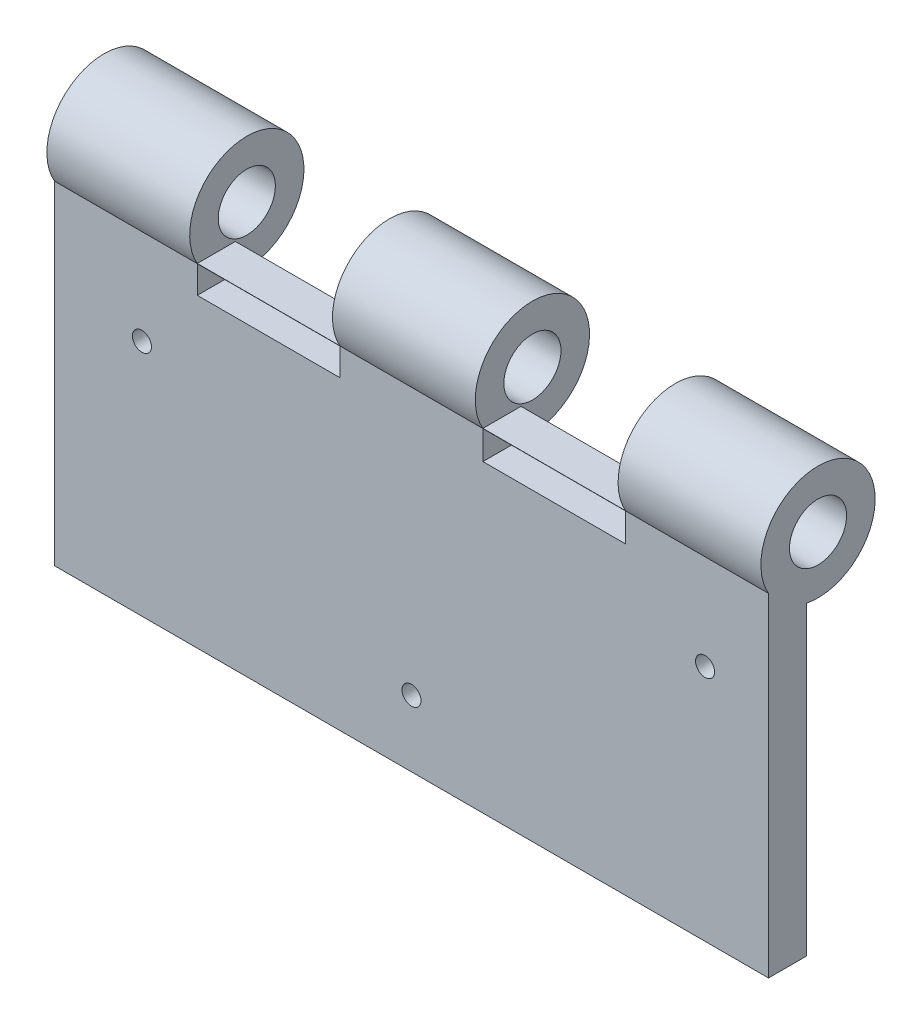
ISO-10303-21;
HEADER;
FILE_DESCRIPTION(('STEP AP214'),'2;1');
FILE_NAME('part.step','',(''),(''),'','','');
FILE_SCHEMA(('AUTOMOTIVE_DESIGN { 1 0 10303 214 1 1 1 1 }'));
ENDSEC;
DATA;
#1=APPLICATION_CONTEXT('core data for automotive mechanical design processes');
#2=APPLICATION_PROTOCOL_DEFINITION('international standard','automotive_design',2000,#1);
#3=PRODUCT_CONTEXT('',#1,'mechanical');
#4=PRODUCT('Part','Part','',(#3));
#5=PRODUCT_RELATED_PRODUCT_CATEGORY('part','',(#4));
#6=PRODUCT_DEFINITION_FORMATION('','',#4);
#7=PRODUCT_DEFINITION_CONTEXT('part definition',#1,'design');
#8=PRODUCT_DEFINITION('design','',#6,#7);
#9=PRODUCT_DEFINITION_SHAPE('','',#8);
#10=(LENGTH_UNIT() NAMED_UNIT(*) SI_UNIT(.MILLI.,.METRE.));
#11=(NAMED_UNIT(*) PLANE_ANGLE_UNIT() SI_UNIT($,.RADIAN.));
#12=(NAMED_UNIT(*) SI_UNIT($,.STERADIAN.) SOLID_ANGLE_UNIT());
#13=UNCERTAINTY_MEASURE_WITH_UNIT(LENGTH_MEASURE(1.E-05),#10,'distance_accuracy_value','');
#14=(GEOMETRIC_REPRESENTATION_CONTEXT(3) GLOBAL_UNCERTAINTY_ASSIGNED_CONTEXT((#13)) GLOBAL_UNIT_ASSIGNED_CONTEXT((#10,
#11,#12)) REPRESENTATION_CONTEXT('',''));
#15=CARTESIAN_POINT('',(0.,0.,0.));
#16=DIRECTION('',(0.,0.,1.));
#17=DIRECTION('',(1.,0.,0.));
#18=AXIS2_PLACEMENT_3D('',#15,#16,#17);
#19=CARTESIAN_POINT('',(0.,0.,-4.));
#20=DIRECTION('',(0.,0.,1.));
#21=DIRECTION('',(1.,0.,0.));
#22=AXIS2_PLACEMENT_3D('',#19,#20,#21);
#23=PLANE('',#22);
#24=DIRECTION('',(0.,1.,0.));
#25=VECTOR('',#24,1.);
#26=CARTESIAN_POINT('',(-15.,0.,-4.));
#27=LINE('',#26,#25);
#28=CARTESIAN_POINT('',(-15.,34.9537531894075,-4.));
#29=VERTEX_POINT('',#28);
#30=CARTESIAN_POINT('',(-15.,35.,-4.));
#31=VERTEX_POINT('',#30);
#32=EDGE_CURVE('E217',#29,#31,#27,.T.);
#33=ORIENTED_EDGE('',*,*,#32,.F.);
#34=DIRECTION('',(1.,0.,0.));
#35=VECTOR('',#34,1.);
#36=CARTESIAN_POINT('',(-15.,34.9537531894075,-4.));
#37=LINE('',#36,#35);
#38=CARTESIAN_POINT('',(-45.,34.9537531894075,-4.));
#39=VERTEX_POINT('',#38);
#40=EDGE_CURVE('E197',#39,#29,#37,.T.);
#41=ORIENTED_EDGE('',*,*,#40,.F.);
#42=DIRECTION('',(0.,1.,0.));
#43=VECTOR('',#42,1.);
#44=CARTESIAN_POINT('',(-45.,0.,-4.));
#45=LINE('',#44,#43);
#46=CARTESIAN_POINT('',(-45.,35.,-4.));
#47=VERTEX_POINT('',#46);
#48=EDGE_CURVE('E295',#39,#47,#45,.T.);
#49=ORIENTED_EDGE('',*,*,#48,.T.);
#50=DIRECTION('',(-1.,0.,0.));
#51=VECTOR('',#50,1.);
#52=CARTESIAN_POINT('',(75.,35.,-4.));
#53=LINE('',#52,#51);
#54=EDGE_CURVE('E280',#31,#47,#53,.T.);
#55=ORIENTED_EDGE('',*,*,#54,.F.);
#56=EDGE_LOOP('',(#33,#41,#49,#55));
#57=FACE_BOUND('',#56,.T.);
#58=ADVANCED_FACE('F58',(#57),#23,.F.);
#59=DIRECTION('',(0.,1.,0.));
#60=VECTOR('',#59,1.);
#61=CARTESIAN_POINT('',(45.,0.,-4.));
#62=LINE('',#61,#60);
#63=CARTESIAN_POINT('',(45.,34.9537531894075,-4.));
#64=VERTEX_POINT('',#63);
#65=CARTESIAN_POINT('',(45.,35.,-4.));
#66=VERTEX_POINT('',#65);
#67=EDGE_CURVE('E288',#64,#66,#62,.T.);
#68=ORIENTED_EDGE('',*,*,#67,.F.);
#69=DIRECTION('',(1.,0.,0.));
#70=VECTOR('',#69,1.);
#71=CARTESIAN_POINT('',(45.,34.9537531894075,-4.));
#72=LINE('',#71,#70);
#73=CARTESIAN_POINT('',(15.,34.9537531894075,-4.));
#74=VERTEX_POINT('',#73);
#75=EDGE_CURVE('E448',#74,#64,#72,.T.);
#76=ORIENTED_EDGE('',*,*,#75,.F.);
#77=DIRECTION('',(0.,1.,0.));
#78=VECTOR('',#77,1.);
#79=CARTESIAN_POINT('',(15.,0.,-4.));
#80=LINE('',#79,#78);
#81=CARTESIAN_POINT('',(15.,35.,-4.));
#82=VERTEX_POINT('',#81);
#83=EDGE_CURVE('E218',#74,#82,#80,.T.);
#84=ORIENTED_EDGE('',*,*,#83,.T.);
#85=EDGE_CURVE('E264',#66,#82,#53,.T.);
#86=ORIENTED_EDGE('',*,*,#85,.F.);
#87=EDGE_LOOP('',(#68,#76,#84,#86));
#88=FACE_BOUND('',#87,.T.);
#89=ADVANCED_FACE('F326',(#88),#23,.F.);
#90=CARTESIAN_POINT('',(75.,35.,4.));
#91=DIRECTION('',(0.,-1.,0.));
#92=DIRECTION('',(1.,0.,0.));
#93=AXIS2_PLACEMENT_3D('',#90,#91,#92);
#94=PLANE('',#93);
#95=ORIENTED_EDGE('',*,*,#54,.T.);
#96=DIRECTION('',(0.,0.,1.));
#97=VECTOR('',#96,1.);
#98=CARTESIAN_POINT('',(-45.,35.,4.));
#99=LINE('',#98,#97);
#100=CARTESIAN_POINT('',(-45.,35.,4.));
#101=VERTEX_POINT('',#100);
#102=EDGE_CURVE('E417',#47,#101,#99,.T.);
#103=ORIENTED_EDGE('',*,*,#102,.T.);
#104=DIRECTION('',(-1.,0.,0.));
#105=VECTOR('',#104,1.);
#106=CARTESIAN_POINT('',(75.,35.,4.));
#107=LINE('',#106,#105);
#108=CARTESIAN_POINT('',(-15.,35.,4.));
#109=VERTEX_POINT('',#108);
#110=EDGE_CURVE('E269',#109,#101,#107,.T.);
#111=ORIENTED_EDGE('',*,*,#110,.F.);
#112=DIRECTION('',(0.,0.,1.));
#113=VECTOR('',#112,1.);
#114=CARTESIAN_POINT('',(-15.,35.,4.));
#115=LINE('',#114,#113);
#116=EDGE_CURVE('E236',#31,#109,#115,.T.);
#117=ORIENTED_EDGE('',*,*,#116,.F.);
#118=EDGE_LOOP('',(#95,#103,#111,#117));
#119=FACE_BOUND('',#118,.T.);
#120=ADVANCED_FACE('F346',(#119),#94,.F.);
#121=CARTESIAN_POINT('',(0.,0.,4.));
#122=DIRECTION('',(0.,0.,1.));
#123=DIRECTION('',(1.,0.,0.));
#124=AXIS2_PLACEMENT_3D('',#121,#122,#123);
#125=PLANE('',#124);
#126=DIRECTION('',(0.,1.,0.));
#127=VECTOR('',#126,1.);
#128=CARTESIAN_POINT('',(-15.,0.,4.));
#129=LINE('',#128,#127);
#130=CARTESIAN_POINT('',(-15.,29.1962923306309,4.));
#131=VERTEX_POINT('',#130);
#132=CARTESIAN_POINT('',(-15.,34.9537531894075,4.));
#133=VERTEX_POINT('',#132);
#134=EDGE_CURVE('E485',#131,#133,#129,.T.);
#135=ORIENTED_EDGE('',*,*,#134,.F.);
#136=DIRECTION('',(1.,0.,0.));
#137=VECTOR('',#136,1.);
#138=CARTESIAN_POINT('',(0.,29.1962923306309,4.));
#139=LINE('',#138,#137);
#140=CARTESIAN_POINT('',(-45.,29.1962923306309,4.));
#141=VERTEX_POINT('',#140);
#142=EDGE_CURVE('E193',#141,#131,#139,.T.);
#143=ORIENTED_EDGE('',*,*,#142,.F.);
#144=DIRECTION('',(0.,-1.,0.));
#145=VECTOR('',#144,1.);
#146=CARTESIAN_POINT('',(-45.,0.,4.));
#147=LINE('',#146,#145);
#148=CARTESIAN_POINT('',(-45.,34.9537531894075,4.));
#149=VERTEX_POINT('',#148);
#150=EDGE_CURVE('E487',#149,#141,#147,.T.);
#151=ORIENTED_EDGE('',*,*,#150,.F.);
#152=DIRECTION('',(-1.,0.,0.));
#153=VECTOR('',#152,1.);
#154=CARTESIAN_POINT('',(0.,34.9537531894075,4.));
#155=LINE('',#154,#153);
#156=EDGE_CURVE('E491',#133,#149,#155,.T.);
#157=ORIENTED_EDGE('',*,*,#156,.F.);
#158=EDGE_LOOP('',(#135,#143,#151,#157));
#159=FACE_BOUND('',#158,.T.);
#160=DIRECTION('',(0.,1.,0.));
#161=VECTOR('',#160,1.);
#162=CARTESIAN_POINT('',(45.,0.,4.));
#163=LINE('',#162,#161);
#164=CARTESIAN_POINT('',(45.,28.9537531894075,4.));
#165=VERTEX_POINT('',#164);
#166=CARTESIAN_POINT('',(45.,34.9537531894075,4.));
#167=VERTEX_POINT('',#166);
#168=EDGE_CURVE('E464',#165,#167,#163,.T.);
#169=ORIENTED_EDGE('',*,*,#168,.F.);
#170=DIRECTION('',(1.,0.,0.));
#171=VECTOR('',#170,1.);
#172=CARTESIAN_POINT('',(0.,28.9537531894075,4.));
#173=LINE('',#172,#171);
#174=CARTESIAN_POINT('',(15.,28.9537531894075,4.));
#175=VERTEX_POINT('',#174);
#176=EDGE_CURVE('E402',#175,#165,#173,.T.);
#177=ORIENTED_EDGE('',*,*,#176,.F.);
#178=DIRECTION('',(0.,-1.,0.));
#179=VECTOR('',#178,1.);
#180=CARTESIAN_POINT('',(15.,0.,4.));
#181=LINE('',#180,#179);
#182=CARTESIAN_POINT('',(15.,34.9537531894075,4.));
#183=VERTEX_POINT('',#182);
#184=EDGE_CURVE('E463',#183,#175,#181,.T.);
#185=ORIENTED_EDGE('',*,*,#184,.F.);
#186=DIRECTION('',(-1.,0.,0.));
#187=VECTOR('',#186,1.);
#188=CARTESIAN_POINT('',(0.,34.9537531894075,4.));
#189=LINE('',#188,#187);
#190=EDGE_CURVE('E459',#167,#183,#189,.T.);
#191=ORIENTED_EDGE('',*,*,#190,.F.);
#192=EDGE_LOOP('',(#169,#177,#185,#191));
#193=FACE_BOUND('',#192,.T.);
#194=CARTESIAN_POINT('',(-56.6305018989095,15.0158637322288,4.));
#195=DIRECTION('',(0.,0.,1.));
#196=DIRECTION('',(1.,0.,0.));
#197=AXIS2_PLACEMENT_3D('',#194,#195,#196);
#198=CIRCLE('',#197,2.);
#199=CARTESIAN_POINT('',(-54.6305018989095,15.0158637322288,4.));
#200=VERTEX_POINT('',#199);
#201=EDGE_CURVE('E390',#200,#200,#198,.T.);
#202=ORIENTED_EDGE('',*,*,#201,.F.);
#203=EDGE_LOOP('',(#202));
#204=FACE_BOUND('',#203,.T.);
#205=CARTESIAN_POINT('',(0.,-21.058085923715,4.));
#206=DIRECTION('',(0.,0.,1.));
#207=DIRECTION('',(1.,0.,0.));
#208=AXIS2_PLACEMENT_3D('',#205,#206,#207);
#209=CIRCLE('',#208,2.);
#210=CARTESIAN_POINT('',(2.,-21.058085923715,4.));
#211=VERTEX_POINT('',#210);
#212=EDGE_CURVE('E393',#211,#211,#209,.T.);
#213=ORIENTED_EDGE('',*,*,#212,.F.);
#214=EDGE_LOOP('',(#213));
#215=FACE_BOUND('',#214,.T.);
#216=CARTESIAN_POINT('',(61.6696567288971,15.0158637322288,4.));
#217=DIRECTION('',(0.,0.,1.));
#218=DIRECTION('',(1.,0.,0.));
#219=AXIS2_PLACEMENT_3D('',#216,#217,#218);
#220=CIRCLE('',#219,2.);
#221=CARTESIAN_POINT('',(63.6696567288971,15.0158637322288,4.));
#222=VERTEX_POINT('',#221);
#223=EDGE_CURVE('E399',#222,#222,#220,.T.);
#224=ORIENTED_EDGE('',*,*,#223,.F.);
#225=EDGE_LOOP('',(#224));
#226=FACE_BOUND('',#225,.T.);
#227=DIRECTION('',(1.,0.,0.));
#228=VECTOR('',#227,1.);
#229=CARTESIAN_POINT('',(-75.,34.9678665123082,4.));
#230=LINE('',#229,#228);
#231=CARTESIAN_POINT('',(-75.,34.9678665123082,4.));
#232=VERTEX_POINT('',#231);
#233=CARTESIAN_POINT('',(-45.,34.9678665123082,4.));
#234=VERTEX_POINT('',#233);
#235=EDGE_CURVE('E415',#232,#234,#230,.T.);
#236=ORIENTED_EDGE('',*,*,#235,.F.);
#237=DIRECTION('',(0.,-1.,0.));
#238=VECTOR('',#237,1.);
#239=CARTESIAN_POINT('',(-75.,-35.,4.));
#240=LINE('',#239,#238);
#241=CARTESIAN_POINT('',(-75.,-35.,4.));
#242=VERTEX_POINT('',#241);
#243=EDGE_CURVE('E261',#232,#242,#240,.T.);
#244=ORIENTED_EDGE('',*,*,#243,.T.);
#245=DIRECTION('',(1.,0.,0.));
#246=VECTOR('',#245,1.);
#247=CARTESIAN_POINT('',(75.,-35.,4.));
#248=LINE('',#247,#246);
#249=CARTESIAN_POINT('',(75.,-35.,4.));
#250=VERTEX_POINT('',#249);
#251=EDGE_CURVE('E263',#242,#250,#248,.T.);
#252=ORIENTED_EDGE('',*,*,#251,.T.);
#253=DIRECTION('',(0.,1.,0.));
#254=VECTOR('',#253,1.);
#255=CARTESIAN_POINT('',(75.,-35.,4.));
#256=LINE('',#255,#254);
#257=CARTESIAN_POINT('',(75.,34.9678665123082,4.));
#258=VERTEX_POINT('',#257);
#259=EDGE_CURVE('E266',#250,#258,#256,.T.);
#260=ORIENTED_EDGE('',*,*,#259,.T.);
#261=DIRECTION('',(1.,0.,0.));
#262=VECTOR('',#261,1.);
#263=CARTESIAN_POINT('',(45.,34.9678665123082,4.));
#264=LINE('',#263,#262);
#265=CARTESIAN_POINT('',(45.,34.9678665123082,4.));
#266=VERTEX_POINT('',#265);
#267=EDGE_CURVE('E258',#266,#258,#264,.T.);
#268=ORIENTED_EDGE('',*,*,#267,.F.);
#269=DIRECTION('',(0.,1.,0.));
#270=VECTOR('',#269,1.);
#271=CARTESIAN_POINT('',(45.,0.,4.));
#272=LINE('',#271,#270);
#273=CARTESIAN_POINT('',(45.,35.,4.));
#274=VERTEX_POINT('',#273);
#275=EDGE_CURVE('E255',#266,#274,#272,.T.);
#276=ORIENTED_EDGE('',*,*,#275,.T.);
#277=CARTESIAN_POINT('',(15.,35.,4.));
#278=VERTEX_POINT('',#277);
#279=EDGE_CURVE('E270',#274,#278,#107,.T.);
#280=ORIENTED_EDGE('',*,*,#279,.T.);
#281=DIRECTION('',(0.,1.,0.));
#282=VECTOR('',#281,1.);
#283=CARTESIAN_POINT('',(15.,0.,4.));
#284=LINE('',#283,#282);
#285=CARTESIAN_POINT('',(15.,34.9678665123082,4.));
#286=VERTEX_POINT('',#285);
#287=EDGE_CURVE('E227',#286,#278,#284,.T.);
#288=ORIENTED_EDGE('',*,*,#287,.F.);
#289=DIRECTION('',(1.,0.,0.));
#290=VECTOR('',#289,1.);
#291=CARTESIAN_POINT('',(-15.,34.9678665123082,4.));
#292=LINE('',#291,#290);
#293=CARTESIAN_POINT('',(-15.,34.9678665123082,4.));
#294=VERTEX_POINT('',#293);
#295=EDGE_CURVE('E239',#294,#286,#292,.T.);
#296=ORIENTED_EDGE('',*,*,#295,.F.);
#297=DIRECTION('',(0.,1.,0.));
#298=VECTOR('',#297,1.);
#299=CARTESIAN_POINT('',(-15.,0.,4.));
#300=LINE('',#299,#298);
#301=EDGE_CURVE('E223',#294,#109,#300,.T.);
#302=ORIENTED_EDGE('',*,*,#301,.T.);
#303=ORIENTED_EDGE('',*,*,#110,.T.);
#304=DIRECTION('',(0.,1.,0.));
#305=VECTOR('',#304,1.);
#306=CARTESIAN_POINT('',(-45.,0.,4.));
#307=LINE('',#306,#305);
#308=EDGE_CURVE('E420',#234,#101,#307,.T.);
#309=ORIENTED_EDGE('',*,*,#308,.F.);
#310=EDGE_LOOP('',(#236,#244,#252,#260,#268,#276,#280,#288,#296,#302,#303,#309));
#311=FACE_BOUND('',#310,.T.);
#312=ADVANCED_FACE('F323',(#159,#193,#204,#215,#226,#311),#125,.T.);
#313=CARTESIAN_POINT('',(-56.6305018989095,15.0158637322288,-4.));
#314=DIRECTION('',(0.,0.,1.));
#315=DIRECTION('',(1.,0.,0.));
#316=AXIS2_PLACEMENT_3D('',#313,#314,#315);
#317=CIRCLE('',#316,5.99999999999998);
#318=CARTESIAN_POINT('',(-50.6305018989095,15.0158637322288,-4.));
#319=VERTEX_POINT('',#318);
#320=EDGE_CURVE('E303',#319,#319,#317,.T.);
#321=ORIENTED_EDGE('',*,*,#320,.T.);
#322=EDGE_LOOP('',(#321));
#323=FACE_BOUND('',#322,.T.);
#324=CARTESIAN_POINT('',(0.,-21.058085923715,-4.));
#325=DIRECTION('',(0.,0.,1.));
#326=DIRECTION('',(1.,0.,0.));
#327=AXIS2_PLACEMENT_3D('',#324,#325,#326);
#328=CIRCLE('',#327,5.99999999999998);
#329=CARTESIAN_POINT('',(5.99999999999998,-21.058085923715,-4.));
#330=VERTEX_POINT('',#329);
#331=EDGE_CURVE('E300',#330,#330,#328,.T.);
#332=ORIENTED_EDGE('',*,*,#331,.T.);
#333=EDGE_LOOP('',(#332));
#334=FACE_BOUND('',#333,.T.);
#335=CARTESIAN_POINT('',(61.6696567288971,15.0158637322288,-4.));
#336=DIRECTION('',(0.,0.,1.));
#337=DIRECTION('',(1.,0.,0.));
#338=AXIS2_PLACEMENT_3D('',#335,#336,#337);
#339=CIRCLE('',#338,5.99999999999994);
#340=CARTESIAN_POINT('',(67.6696567288971,15.0158637322288,-4.));
#341=VERTEX_POINT('',#340);
#342=EDGE_CURVE('E297',#341,#341,#339,.T.);
#343=ORIENTED_EDGE('',*,*,#342,.T.);
#344=EDGE_LOOP('',(#343));
#345=FACE_BOUND('',#344,.T.);
#346=DIRECTION('',(1.,0.,0.));
#347=VECTOR('',#346,1.);
#348=CARTESIAN_POINT('',(-75.,29.1962923306309,-4.));
#349=LINE('',#348,#347);
#350=CARTESIAN_POINT('',(-75.,29.1962923306309,-4.));
#351=VERTEX_POINT('',#350);
#352=CARTESIAN_POINT('',(-45.,29.1962923306309,-4.));
#353=VERTEX_POINT('',#352);
#354=EDGE_CURVE('E207',#351,#353,#349,.T.);
#355=ORIENTED_EDGE('',*,*,#354,.T.);
#356=DIRECTION('',(-1.,0.,0.));
#357=VECTOR('',#356,1.);
#358=CARTESIAN_POINT('',(-15.,29.1962923306309,-4.));
#359=LINE('',#358,#357);
#360=CARTESIAN_POINT('',(-15.,29.1962923306309,-4.));
#361=VERTEX_POINT('',#360);
#362=EDGE_CURVE('E191',#361,#353,#359,.T.);
#363=ORIENTED_EDGE('',*,*,#362,.F.);
#364=DIRECTION('',(1.,0.,0.));
#365=VECTOR('',#364,1.);
#366=CARTESIAN_POINT('',(-15.,29.1962923306309,-4.));
#367=LINE('',#366,#365);
#368=CARTESIAN_POINT('',(15.,29.1962923306309,-4.));
#369=VERTEX_POINT('',#368);
#370=EDGE_CURVE('E205',#361,#369,#367,.T.);
#371=ORIENTED_EDGE('',*,*,#370,.T.);
#372=DIRECTION('',(0.,1.,0.));
#373=VECTOR('',#372,1.);
#374=CARTESIAN_POINT('',(15.,34.9537531894075,-4.));
#375=LINE('',#374,#373);
#376=CARTESIAN_POINT('',(15.,28.9537531894075,-4.));
#377=VERTEX_POINT('',#376);
#378=EDGE_CURVE('E434',#377,#369,#375,.T.);
#379=ORIENTED_EDGE('',*,*,#378,.F.);
#380=DIRECTION('',(-1.,0.,0.));
#381=VECTOR('',#380,1.);
#382=CARTESIAN_POINT('',(45.,28.9537531894075,-4.));
#383=LINE('',#382,#381);
#384=CARTESIAN_POINT('',(45.,28.9537531894075,-4.));
#385=VERTEX_POINT('',#384);
#386=EDGE_CURVE('E453',#385,#377,#383,.T.);
#387=ORIENTED_EDGE('',*,*,#386,.F.);
#388=DIRECTION('',(0.,-1.,0.));
#389=VECTOR('',#388,1.);
#390=CARTESIAN_POINT('',(45.,34.9537531894075,-4.));
#391=LINE('',#390,#389);
#392=CARTESIAN_POINT('',(45.,29.1962923306309,-4.));
#393=VERTEX_POINT('',#392);
#394=EDGE_CURVE('E474',#393,#385,#391,.T.);
#395=ORIENTED_EDGE('',*,*,#394,.F.);
#396=DIRECTION('',(1.,0.,0.));
#397=VECTOR('',#396,1.);
#398=CARTESIAN_POINT('',(45.,29.1962923306309,-4.));
#399=LINE('',#398,#397);
#400=CARTESIAN_POINT('',(75.,29.1962923306309,-4.));
#401=VERTEX_POINT('',#400);
#402=EDGE_CURVE('E290',#393,#401,#399,.T.);
#403=ORIENTED_EDGE('',*,*,#402,.T.);
#404=DIRECTION('',(0.,1.,0.));
#405=VECTOR('',#404,1.);
#406=CARTESIAN_POINT('',(75.,-35.,-4.));
#407=LINE('',#406,#405);
#408=CARTESIAN_POINT('',(75.,-35.,-4.));
#409=VERTEX_POINT('',#408);
#410=EDGE_CURVE('E277',#409,#401,#407,.T.);
#411=ORIENTED_EDGE('',*,*,#410,.F.);
#412=DIRECTION('',(1.,0.,0.));
#413=VECTOR('',#412,1.);
#414=CARTESIAN_POINT('',(75.,-35.,-4.));
#415=LINE('',#414,#413);
#416=CARTESIAN_POINT('',(-75.,-35.,-4.));
#417=VERTEX_POINT('',#416);
#418=EDGE_CURVE('E275',#417,#409,#415,.T.);
#419=ORIENTED_EDGE('',*,*,#418,.F.);
#420=DIRECTION('',(0.,-1.,0.));
#421=VECTOR('',#420,1.);
#422=CARTESIAN_POINT('',(-75.,-35.,-4.));
#423=LINE('',#422,#421);
#424=EDGE_CURVE('E260',#351,#417,#423,.T.);
#425=ORIENTED_EDGE('',*,*,#424,.F.);
#426=EDGE_LOOP('',(#355,#363,#371,#379,#387,#395,#403,#411,#419,#425));
#427=FACE_BOUND('',#426,.T.);
#428=ADVANCED_FACE('F203',(#323,#334,#345,#427),#23,.F.);
#429=ORIENTED_EDGE('',*,*,#85,.T.);
#430=DIRECTION('',(0.,0.,1.));
#431=VECTOR('',#430,1.);
#432=CARTESIAN_POINT('',(15.,35.,4.));
#433=LINE('',#432,#431);
#434=EDGE_CURVE('E224',#82,#278,#433,.T.);
#435=ORIENTED_EDGE('',*,*,#434,.T.);
#436=ORIENTED_EDGE('',*,*,#279,.F.);
#437=DIRECTION('',(0.,0.,1.));
#438=VECTOR('',#437,1.);
#439=CARTESIAN_POINT('',(45.,35.,4.));
#440=LINE('',#439,#438);
#441=EDGE_CURVE('E251',#66,#274,#440,.T.);
#442=ORIENTED_EDGE('',*,*,#441,.F.);
#443=EDGE_LOOP('',(#429,#435,#436,#442));
#444=FACE_BOUND('',#443,.T.);
#445=ADVANCED_FACE('F322',(#444),#94,.F.);
#446=CARTESIAN_POINT('',(-75.,-35.,4.));
#447=DIRECTION('',(1.,0.,0.));
#448=DIRECTION('',(0.,0.,-1.));
#449=AXIS2_PLACEMENT_3D('',#446,#447,#448);
#450=PLANE('',#449);
#451=ORIENTED_EDGE('',*,*,#243,.F.);
#452=CARTESIAN_POINT('',(-75.,40.9537531894075,-6.40044040841181));
#453=DIRECTION('',(1.,0.,0.));
#454=DIRECTION('',(0.,0.,-1.));
#455=AXIS2_PLACEMENT_3D('',#452,#453,#454);
#456=CIRCLE('',#455,12.);
#457=EDGE_CURVE('E410',#351,#232,#456,.T.);
#458=ORIENTED_EDGE('',*,*,#457,.F.);
#459=ORIENTED_EDGE('',*,*,#424,.T.);
#460=DIRECTION('',(0.,0.,-1.));
#461=VECTOR('',#460,1.);
#462=CARTESIAN_POINT('',(-75.,-35.,4.));
#463=LINE('',#462,#461);
#464=EDGE_CURVE('E285',#242,#417,#463,.T.);
#465=ORIENTED_EDGE('',*,*,#464,.F.);
#466=EDGE_LOOP('',(#451,#458,#459,#465));
#467=FACE_BOUND('',#466,.T.);
#468=CARTESIAN_POINT('',(-75.,40.9537531894075,-6.40044040841181));
#469=DIRECTION('',(1.,0.,0.));
#470=DIRECTION('',(0.,0.,-1.));
#471=AXIS2_PLACEMENT_3D('',#468,#469,#470);
#472=CIRCLE('',#471,6.);
#473=CARTESIAN_POINT('',(-75.,40.9537531894075,-12.4004404084118));
#474=VERTEX_POINT('',#473);
#475=EDGE_CURVE('E396',#474,#474,#472,.T.);
#476=ORIENTED_EDGE('',*,*,#475,.T.);
#477=EDGE_LOOP('',(#476));
#478=FACE_BOUND('',#477,.T.);
#479=ADVANCED_FACE('F354',(#467,#478),#450,.F.);
#480=CARTESIAN_POINT('',(75.,-35.,4.));
#481=DIRECTION('',(0.,1.,0.));
#482=DIRECTION('',(-1.,0.,0.));
#483=AXIS2_PLACEMENT_3D('',#480,#481,#482);
#484=PLANE('',#483);
#485=ORIENTED_EDGE('',*,*,#418,.T.);
#486=DIRECTION('',(0.,0.,-1.));
#487=VECTOR('',#486,1.);
#488=CARTESIAN_POINT('',(75.,-35.,4.));
#489=LINE('',#488,#487);
#490=EDGE_CURVE('E273',#250,#409,#489,.T.);
#491=ORIENTED_EDGE('',*,*,#490,.F.);
#492=ORIENTED_EDGE('',*,*,#251,.F.);
#493=ORIENTED_EDGE('',*,*,#464,.T.);
#494=EDGE_LOOP('',(#485,#491,#492,#493));
#495=FACE_BOUND('',#494,.T.);
#496=ADVANCED_FACE('F360',(#495),#484,.F.);
#497=CARTESIAN_POINT('',(75.,-35.,4.));
#498=DIRECTION('',(-1.,0.,0.));
#499=DIRECTION('',(0.,0.,1.));
#500=AXIS2_PLACEMENT_3D('',#497,#498,#499);
#501=PLANE('',#500);
#502=ORIENTED_EDGE('',*,*,#410,.T.);
#503=CARTESIAN_POINT('',(75.,40.9537531894075,-6.40044040841181));
#504=DIRECTION('',(1.,0.,0.));
#505=DIRECTION('',(0.,0.,-1.));
#506=AXIS2_PLACEMENT_3D('',#503,#504,#505);
#507=CIRCLE('',#506,12.);
#508=EDGE_CURVE('E245',#401,#258,#507,.T.);
#509=ORIENTED_EDGE('',*,*,#508,.T.);
#510=ORIENTED_EDGE('',*,*,#259,.F.);
#511=ORIENTED_EDGE('',*,*,#490,.T.);
#512=EDGE_LOOP('',(#502,#509,#510,#511));
#513=FACE_BOUND('',#512,.T.);
#514=CARTESIAN_POINT('',(75.,40.9537531894075,-6.40044040841181));
#515=DIRECTION('',(1.,0.,0.));
#516=DIRECTION('',(0.,0.,-1.));
#517=AXIS2_PLACEMENT_3D('',#514,#515,#516);
#518=CIRCLE('',#517,6.);
#519=CARTESIAN_POINT('',(75.,40.9537531894075,-12.4004404084118));
#520=VERTEX_POINT('',#519);
#521=EDGE_CURVE('E241',#520,#520,#518,.T.);
#522=ORIENTED_EDGE('',*,*,#521,.F.);
#523=EDGE_LOOP('',(#522));
#524=FACE_BOUND('',#523,.T.);
#525=ADVANCED_FACE('F356',(#513,#524),#501,.F.);
#526=CARTESIAN_POINT('',(45.,40.9537531894075,-6.40044040841181));
#527=DIRECTION('',(1.,0.,0.));
#528=DIRECTION('',(0.,0.,-1.));
#529=AXIS2_PLACEMENT_3D('',#526,#527,#528);
#530=CYLINDRICAL_SURFACE('',#529,12.);
#531=CARTESIAN_POINT('',(45.,40.9537531894075,-6.40044040841181));
#532=DIRECTION('',(1.,0.,0.));
#533=DIRECTION('',(0.,0.,-1.));
#534=AXIS2_PLACEMENT_3D('',#531,#532,#533);
#535=CIRCLE('',#534,12.);
#536=EDGE_CURVE('E248',#393,#266,#535,.T.);
#537=ORIENTED_EDGE('',*,*,#536,.T.);
#538=ORIENTED_EDGE('',*,*,#267,.T.);
#539=ORIENTED_EDGE('',*,*,#508,.F.);
#540=ORIENTED_EDGE('',*,*,#402,.F.);
#541=EDGE_LOOP('',(#537,#538,#539,#540));
#542=FACE_BOUND('',#541,.T.);
#543=ADVANCED_FACE('F359',(#542),#530,.T.);
#544=CARTESIAN_POINT('',(45.,40.9537531894075,-6.40044040841181));
#545=DIRECTION('',(1.,0.,0.));
#546=DIRECTION('',(0.,0.,-1.));
#547=AXIS2_PLACEMENT_3D('',#544,#545,#546);
#548=PLANE('',#547);
#549=ORIENTED_EDGE('',*,*,#275,.F.);
#550=ORIENTED_EDGE('',*,*,#536,.F.);
#551=ORIENTED_EDGE('',*,*,#394,.T.);
#552=DIRECTION('',(0.,0.,-1.));
#553=VECTOR('',#552,1.);
#554=CARTESIAN_POINT('',(45.,28.9537531894075,6.));
#555=LINE('',#554,#553);
#556=EDGE_CURVE('E450',#165,#385,#555,.T.);
#557=ORIENTED_EDGE('',*,*,#556,.F.);
#558=ORIENTED_EDGE('',*,*,#168,.T.);
#559=DIRECTION('',(0.,0.,-1.));
#560=VECTOR('',#559,1.);
#561=CARTESIAN_POINT('',(45.,34.9537531894075,6.));
#562=LINE('',#561,#560);
#563=EDGE_CURVE('E457',#167,#64,#562,.T.);
#564=ORIENTED_EDGE('',*,*,#563,.T.);
#565=ORIENTED_EDGE('',*,*,#67,.T.);
#566=ORIENTED_EDGE('',*,*,#441,.T.);
#567=EDGE_LOOP('',(#549,#550,#551,#557,#558,#564,#565,#566));
#568=FACE_BOUND('',#567,.T.);
#569=CARTESIAN_POINT('',(45.,40.9537531894075,-6.40044040841181));
#570=DIRECTION('',(1.,0.,0.));
#571=DIRECTION('',(0.,0.,-1.));
#572=AXIS2_PLACEMENT_3D('',#569,#570,#571);
#573=CIRCLE('',#572,6.);
#574=CARTESIAN_POINT('',(45.,40.9537531894075,-12.4004404084118));
#575=VERTEX_POINT('',#574);
#576=EDGE_CURVE('E242',#575,#575,#573,.T.);
#577=ORIENTED_EDGE('',*,*,#576,.T.);
#578=EDGE_LOOP('',(#577));
#579=FACE_BOUND('',#578,.T.);
#580=ADVANCED_FACE('F471',(#568,#579),#548,.F.);
#581=CARTESIAN_POINT('',(45.,40.9537531894075,-6.40044040841181));
#582=DIRECTION('',(1.,0.,0.));
#583=DIRECTION('',(0.,0.,-1.));
#584=AXIS2_PLACEMENT_3D('',#581,#582,#583);
#585=CYLINDRICAL_SURFACE('',#584,6.);
#586=ORIENTED_EDGE('',*,*,#576,.F.);
#587=EDGE_LOOP('',(#586));
#588=FACE_BOUND('',#587,.T.);
#589=ORIENTED_EDGE('',*,*,#521,.T.);
#590=EDGE_LOOP('',(#589));
#591=FACE_BOUND('',#590,.T.);
#592=ADVANCED_FACE('F549',(#588,#591),#585,.F.);
#593=CARTESIAN_POINT('',(-15.,40.9537531894075,-6.40044040841181));
#594=DIRECTION('',(1.,0.,0.));
#595=DIRECTION('',(0.,0.,-1.));
#596=AXIS2_PLACEMENT_3D('',#593,#594,#595);
#597=CYLINDRICAL_SURFACE('',#596,12.);
#598=CARTESIAN_POINT('',(-15.,40.9537531894075,-6.40044040841181));
#599=DIRECTION('',(1.,0.,0.));
#600=DIRECTION('',(0.,0.,-1.));
#601=AXIS2_PLACEMENT_3D('',#598,#599,#600);
#602=CIRCLE('',#601,12.);
#603=EDGE_CURVE('E213',#361,#294,#602,.T.);
#604=ORIENTED_EDGE('',*,*,#603,.T.);
#605=ORIENTED_EDGE('',*,*,#295,.T.);
#606=CARTESIAN_POINT('',(15.,40.9537531894075,-6.40044040841181));
#607=DIRECTION('',(1.,0.,0.));
#608=DIRECTION('',(0.,0.,-1.));
#609=AXIS2_PLACEMENT_3D('',#606,#607,#608);
#610=CIRCLE('',#609,12.);
#611=EDGE_CURVE('E216',#369,#286,#610,.T.);
#612=ORIENTED_EDGE('',*,*,#611,.F.);
#613=ORIENTED_EDGE('',*,*,#370,.F.);
#614=EDGE_LOOP('',(#604,#605,#612,#613));
#615=FACE_BOUND('',#614,.T.);
#616=ADVANCED_FACE('F212',(#615),#597,.T.);
#617=CARTESIAN_POINT('',(-15.,40.9537531894075,-6.40044040841181));
#618=DIRECTION('',(1.,0.,0.));
#619=DIRECTION('',(0.,0.,-1.));
#620=AXIS2_PLACEMENT_3D('',#617,#618,#619);
#621=PLANE('',#620);
#622=ORIENTED_EDGE('',*,*,#301,.F.);
#623=ORIENTED_EDGE('',*,*,#603,.F.);
#624=DIRECTION('',(0.,0.,-1.));
#625=VECTOR('',#624,1.);
#626=CARTESIAN_POINT('',(-15.,29.1962923306309,6.));
#627=LINE('',#626,#625);
#628=EDGE_CURVE('E188',#131,#361,#627,.T.);
#629=ORIENTED_EDGE('',*,*,#628,.F.);
#630=ORIENTED_EDGE('',*,*,#134,.T.);
#631=DIRECTION('',(0.,0.,-1.));
#632=VECTOR('',#631,1.);
#633=CARTESIAN_POINT('',(-15.,34.9537531894075,6.));
#634=LINE('',#633,#632);
#635=EDGE_CURVE('E493',#133,#29,#634,.T.);
#636=ORIENTED_EDGE('',*,*,#635,.T.);
#637=ORIENTED_EDGE('',*,*,#32,.T.);
#638=ORIENTED_EDGE('',*,*,#116,.T.);
#639=EDGE_LOOP('',(#622,#623,#629,#630,#636,#637,#638));
#640=FACE_BOUND('',#639,.T.);
#641=CARTESIAN_POINT('',(-15.,40.9537531894075,-6.40044040841181));
#642=DIRECTION('',(1.,0.,0.));
#643=DIRECTION('',(0.,0.,-1.));
#644=AXIS2_PLACEMENT_3D('',#641,#642,#643);
#645=CIRCLE('',#644,6.);
#646=CARTESIAN_POINT('',(-15.,40.9537531894075,-12.4004404084118));
#647=VERTEX_POINT('',#646);
#648=EDGE_CURVE('E229',#647,#647,#645,.T.);
#649=ORIENTED_EDGE('',*,*,#648,.T.);
#650=EDGE_LOOP('',(#649));
#651=FACE_BOUND('',#650,.T.);
#652=ADVANCED_FACE('F220',(#640,#651),#621,.F.);
#653=CARTESIAN_POINT('',(15.,40.9537531894075,-6.40044040841181));
#654=DIRECTION('',(1.,0.,0.));
#655=DIRECTION('',(0.,0.,-1.));
#656=AXIS2_PLACEMENT_3D('',#653,#654,#655);
#657=PLANE('',#656);
#658=CARTESIAN_POINT('',(15.,40.9537531894075,-6.40044040841181));
#659=DIRECTION('',(1.,0.,0.));
#660=DIRECTION('',(0.,0.,-1.));
#661=AXIS2_PLACEMENT_3D('',#658,#659,#660);
#662=CIRCLE('',#661,6.);
#663=CARTESIAN_POINT('',(15.,40.9537531894075,-12.4004404084118));
#664=VERTEX_POINT('',#663);
#665=EDGE_CURVE('E232',#664,#664,#662,.T.);
#666=ORIENTED_EDGE('',*,*,#665,.F.);
#667=EDGE_LOOP('',(#666));
#668=FACE_BOUND('',#667,.T.);
#669=ORIENTED_EDGE('',*,*,#611,.T.);
#670=ORIENTED_EDGE('',*,*,#287,.T.);
#671=ORIENTED_EDGE('',*,*,#434,.F.);
#672=ORIENTED_EDGE('',*,*,#83,.F.);
#673=DIRECTION('',(0.,0.,-1.));
#674=VECTOR('',#673,1.);
#675=CARTESIAN_POINT('',(15.,34.9537531894075,6.));
#676=LINE('',#675,#674);
#677=EDGE_CURVE('E443',#183,#74,#676,.T.);
#678=ORIENTED_EDGE('',*,*,#677,.F.);
#679=ORIENTED_EDGE('',*,*,#184,.T.);
#680=DIRECTION('',(0.,0.,-1.));
#681=VECTOR('',#680,1.);
#682=CARTESIAN_POINT('',(15.,28.9537531894075,6.));
#683=LINE('',#682,#681);
#684=EDGE_CURVE('E82',#175,#377,#683,.T.);
#685=ORIENTED_EDGE('',*,*,#684,.T.);
#686=ORIENTED_EDGE('',*,*,#378,.T.);
#687=EDGE_LOOP('',(#669,#670,#671,#672,#678,#679,#685,#686));
#688=FACE_BOUND('',#687,.T.);
#689=ADVANCED_FACE('F428',(#668,#688),#657,.T.);
#690=CARTESIAN_POINT('',(-15.,40.9537531894075,-6.40044040841181));
#691=DIRECTION('',(1.,0.,0.));
#692=DIRECTION('',(0.,0.,-1.));
#693=AXIS2_PLACEMENT_3D('',#690,#691,#692);
#694=CYLINDRICAL_SURFACE('',#693,6.);
#695=ORIENTED_EDGE('',*,*,#648,.F.);
#696=EDGE_LOOP('',(#695));
#697=FACE_BOUND('',#696,.T.);
#698=ORIENTED_EDGE('',*,*,#665,.T.);
#699=EDGE_LOOP('',(#698));
#700=FACE_BOUND('',#699,.T.);
#701=ADVANCED_FACE('F426',(#697,#700),#694,.F.);
#702=CARTESIAN_POINT('',(-75.,40.9537531894075,-6.40044040841181));
#703=DIRECTION('',(1.,0.,0.));
#704=DIRECTION('',(0.,0.,-1.));
#705=AXIS2_PLACEMENT_3D('',#702,#703,#704);
#706=CYLINDRICAL_SURFACE('',#705,12.);
#707=ORIENTED_EDGE('',*,*,#457,.T.);
#708=ORIENTED_EDGE('',*,*,#235,.T.);
#709=CARTESIAN_POINT('',(-45.,40.9537531894075,-6.40044040841181));
#710=DIRECTION('',(1.,0.,0.));
#711=DIRECTION('',(0.,0.,-1.));
#712=AXIS2_PLACEMENT_3D('',#709,#710,#711);
#713=CIRCLE('',#712,12.);
#714=EDGE_CURVE('E408',#353,#234,#713,.T.);
#715=ORIENTED_EDGE('',*,*,#714,.F.);
#716=ORIENTED_EDGE('',*,*,#354,.F.);
#717=EDGE_LOOP('',(#707,#708,#715,#716));
#718=FACE_BOUND('',#717,.T.);
#719=ADVANCED_FACE('F520',(#718),#706,.T.);
#720=CARTESIAN_POINT('',(-45.,40.9537531894075,-6.40044040841181));
#721=DIRECTION('',(1.,0.,0.));
#722=DIRECTION('',(0.,0.,-1.));
#723=AXIS2_PLACEMENT_3D('',#720,#721,#722);
#724=PLANE('',#723);
#725=CARTESIAN_POINT('',(-45.,40.9537531894075,-6.40044040841181));
#726=DIRECTION('',(1.,0.,0.));
#727=DIRECTION('',(0.,0.,-1.));
#728=AXIS2_PLACEMENT_3D('',#725,#726,#727);
#729=CIRCLE('',#728,6.);
#730=CARTESIAN_POINT('',(-45.,40.9537531894075,-12.4004404084118));
#731=VERTEX_POINT('',#730);
#732=EDGE_CURVE('E392',#731,#731,#729,.T.);
#733=ORIENTED_EDGE('',*,*,#732,.F.);
#734=EDGE_LOOP('',(#733));
#735=FACE_BOUND('',#734,.T.);
#736=ORIENTED_EDGE('',*,*,#714,.T.);
#737=ORIENTED_EDGE('',*,*,#308,.T.);
#738=ORIENTED_EDGE('',*,*,#102,.F.);
#739=ORIENTED_EDGE('',*,*,#48,.F.);
#740=DIRECTION('',(0.,0.,-1.));
#741=VECTOR('',#740,1.);
#742=CARTESIAN_POINT('',(-45.,34.9537531894075,6.));
#743=LINE('',#742,#741);
#744=EDGE_CURVE('E496',#149,#39,#743,.T.);
#745=ORIENTED_EDGE('',*,*,#744,.F.);
#746=ORIENTED_EDGE('',*,*,#150,.T.);
#747=DIRECTION('',(0.,0.,-1.));
#748=VECTOR('',#747,1.);
#749=CARTESIAN_POINT('',(-45.,29.1962923306309,6.));
#750=LINE('',#749,#748);
#751=EDGE_CURVE('E74',#141,#353,#750,.T.);
#752=ORIENTED_EDGE('',*,*,#751,.T.);
#753=EDGE_LOOP('',(#736,#737,#738,#739,#745,#746,#752));
#754=FACE_BOUND('',#753,.T.);
#755=ADVANCED_FACE('F517',(#735,#754),#724,.T.);
#756=CARTESIAN_POINT('',(-75.,40.9537531894075,-6.40044040841181));
#757=DIRECTION('',(1.,0.,0.));
#758=DIRECTION('',(0.,0.,-1.));
#759=AXIS2_PLACEMENT_3D('',#756,#757,#758);
#760=CYLINDRICAL_SURFACE('',#759,6.);
#761=ORIENTED_EDGE('',*,*,#475,.F.);
#762=EDGE_LOOP('',(#761));
#763=FACE_BOUND('',#762,.T.);
#764=ORIENTED_EDGE('',*,*,#732,.T.);
#765=EDGE_LOOP('',(#764));
#766=FACE_BOUND('',#765,.T.);
#767=ADVANCED_FACE('F526',(#763,#766),#760,.F.);
#768=CARTESIAN_POINT('',(61.6696567288971,15.0158637322288,-26.));
#769=DIRECTION('',(0.,0.,1.));
#770=DIRECTION('',(1.,0.,0.));
#771=AXIS2_PLACEMENT_3D('',#768,#769,#770);
#772=CYLINDRICAL_SURFACE('',#771,2.);
#773=CARTESIAN_POINT('',(61.6696567288971,15.0158637322288,0.));
#774=DIRECTION('',(0.,0.,1.));
#775=DIRECTION('',(1.,0.,0.));
#776=AXIS2_PLACEMENT_3D('',#773,#774,#775);
#777=CIRCLE('',#776,2.);
#778=CARTESIAN_POINT('',(63.6696567288971,15.0158637322288,0.));
#779=VERTEX_POINT('',#778);
#780=EDGE_CURVE('E12',#779,#779,#777,.F.);
#781=ORIENTED_EDGE('',*,*,#780,.T.);
#782=EDGE_LOOP('',(#781));
#783=FACE_BOUND('',#782,.T.);
#784=ORIENTED_EDGE('',*,*,#223,.T.);
#785=EDGE_LOOP('',(#784));
#786=FACE_BOUND('',#785,.T.);
#787=ADVANCED_FACE('F529',(#783,#786),#772,.F.);
#788=CARTESIAN_POINT('',(0.,-21.058085923715,-26.));
#789=DIRECTION('',(0.,0.,1.));
#790=DIRECTION('',(1.,0.,0.));
#791=AXIS2_PLACEMENT_3D('',#788,#789,#790);
#792=CYLINDRICAL_SURFACE('',#791,2.);
#793=CARTESIAN_POINT('',(0.,-21.058085923715,0.));
#794=DIRECTION('',(0.,0.,1.));
#795=DIRECTION('',(1.,0.,0.));
#796=AXIS2_PLACEMENT_3D('',#793,#794,#795);
#797=CIRCLE('',#796,2.);
#798=CARTESIAN_POINT('',(2.,-21.058085923715,0.));
#799=VERTEX_POINT('',#798);
#800=EDGE_CURVE('E67',#799,#799,#797,.F.);
#801=ORIENTED_EDGE('',*,*,#800,.T.);
#802=EDGE_LOOP('',(#801));
#803=FACE_BOUND('',#802,.T.);
#804=ORIENTED_EDGE('',*,*,#212,.T.);
#805=EDGE_LOOP('',(#804));
#806=FACE_BOUND('',#805,.T.);
#807=ADVANCED_FACE('F311',(#803,#806),#792,.F.);
#808=CARTESIAN_POINT('',(-56.6305018989095,15.0158637322288,-26.));
#809=DIRECTION('',(0.,0.,1.));
#810=DIRECTION('',(1.,0.,0.));
#811=AXIS2_PLACEMENT_3D('',#808,#809,#810);
#812=CYLINDRICAL_SURFACE('',#811,2.);
#813=CARTESIAN_POINT('',(-56.6305018989095,15.0158637322288,0.));
#814=DIRECTION('',(0.,0.,1.));
#815=DIRECTION('',(1.,0.,0.));
#816=AXIS2_PLACEMENT_3D('',#813,#814,#815);
#817=CIRCLE('',#816,2.);
#818=CARTESIAN_POINT('',(-54.6305018989095,15.0158637322288,0.));
#819=VERTEX_POINT('',#818);
#820=EDGE_CURVE('E306',#819,#819,#817,.F.);
#821=ORIENTED_EDGE('',*,*,#820,.T.);
#822=EDGE_LOOP('',(#821));
#823=FACE_BOUND('',#822,.T.);
#824=ORIENTED_EDGE('',*,*,#201,.T.);
#825=EDGE_LOOP('',(#824));
#826=FACE_BOUND('',#825,.T.);
#827=ADVANCED_FACE('F373',(#823,#826),#812,.F.);
#828=CARTESIAN_POINT('',(-56.6305018989095,15.0158637322288,-4.));
#829=DIRECTION('',(0.,0.,-1.));
#830=DIRECTION('',(-1.,0.,0.));
#831=AXIS2_PLACEMENT_3D('',#828,#829,#830);
#832=CONICAL_SURFACE('',#831,5.99999999999998,0.785398163397446);
#833=ORIENTED_EDGE('',*,*,#820,.F.);
#834=EDGE_LOOP('',(#833));
#835=FACE_BOUND('',#834,.T.);
#836=ORIENTED_EDGE('',*,*,#320,.F.);
#837=EDGE_LOOP('',(#836));
#838=FACE_BOUND('',#837,.T.);
#839=ADVANCED_FACE('F317',(#835,#838),#832,.F.);
#840=CARTESIAN_POINT('',(0.,-21.058085923715,-4.));
#841=DIRECTION('',(0.,0.,-1.));
#842=DIRECTION('',(-1.,0.,0.));
#843=AXIS2_PLACEMENT_3D('',#840,#841,#842);
#844=CONICAL_SURFACE('',#843,5.99999999999998,0.785398163397446);
#845=ORIENTED_EDGE('',*,*,#800,.F.);
#846=EDGE_LOOP('',(#845));
#847=FACE_BOUND('',#846,.T.);
#848=ORIENTED_EDGE('',*,*,#331,.F.);
#849=EDGE_LOOP('',(#848));
#850=FACE_BOUND('',#849,.T.);
#851=ADVANCED_FACE('F314',(#847,#850),#844,.F.);
#852=CARTESIAN_POINT('',(61.6696567288971,15.0158637322288,-4.));
#853=DIRECTION('',(0.,0.,-1.));
#854=DIRECTION('',(-1.,0.,0.));
#855=AXIS2_PLACEMENT_3D('',#852,#853,#854);
#856=CONICAL_SURFACE('',#855,5.99999999999994,0.785398163397446);
#857=ORIENTED_EDGE('',*,*,#780,.F.);
#858=EDGE_LOOP('',(#857));
#859=FACE_BOUND('',#858,.T.);
#860=ORIENTED_EDGE('',*,*,#342,.F.);
#861=EDGE_LOOP('',(#860));
#862=FACE_BOUND('',#861,.T.);
#863=ADVANCED_FACE('F61',(#859,#862),#856,.F.);
#864=CARTESIAN_POINT('',(45.,34.9537531894075,6.));
#865=DIRECTION('',(0.,1.,0.));
#866=DIRECTION('',(0.,0.,1.));
#867=AXIS2_PLACEMENT_3D('',#864,#865,#866);
#868=PLANE('',#867);
#869=ORIENTED_EDGE('',*,*,#190,.T.);
#870=ORIENTED_EDGE('',*,*,#677,.T.);
#871=ORIENTED_EDGE('',*,*,#75,.T.);
#872=ORIENTED_EDGE('',*,*,#563,.F.);
#873=EDGE_LOOP('',(#869,#870,#871,#872));
#874=FACE_BOUND('',#873,.T.);
#875=ADVANCED_FACE('F330',(#874),#868,.F.);
#876=CARTESIAN_POINT('',(45.,28.9537531894075,6.));
#877=DIRECTION('',(0.,-1.,0.));
#878=DIRECTION('',(0.,0.,-1.));
#879=AXIS2_PLACEMENT_3D('',#876,#877,#878);
#880=PLANE('',#879);
#881=ORIENTED_EDGE('',*,*,#176,.T.);
#882=ORIENTED_EDGE('',*,*,#556,.T.);
#883=ORIENTED_EDGE('',*,*,#386,.T.);
#884=ORIENTED_EDGE('',*,*,#684,.F.);
#885=EDGE_LOOP('',(#881,#882,#883,#884));
#886=FACE_BOUND('',#885,.T.);
#887=ADVANCED_FACE('F335',(#886),#880,.F.);
#888=CARTESIAN_POINT('',(-15.,34.9537531894075,6.));
#889=DIRECTION('',(0.,1.,0.));
#890=DIRECTION('',(0.,0.,1.));
#891=AXIS2_PLACEMENT_3D('',#888,#889,#890);
#892=PLANE('',#891);
#893=ORIENTED_EDGE('',*,*,#156,.T.);
#894=ORIENTED_EDGE('',*,*,#744,.T.);
#895=ORIENTED_EDGE('',*,*,#40,.T.);
#896=ORIENTED_EDGE('',*,*,#635,.F.);
#897=EDGE_LOOP('',(#893,#894,#895,#896));
#898=FACE_BOUND('',#897,.T.);
#899=ADVANCED_FACE('F503',(#898),#892,.F.);
#900=CARTESIAN_POINT('',(-15.,29.1962923306309,6.));
#901=DIRECTION('',(0.,-1.,0.));
#902=DIRECTION('',(0.,0.,-1.));
#903=AXIS2_PLACEMENT_3D('',#900,#901,#902);
#904=PLANE('',#903);
#905=ORIENTED_EDGE('',*,*,#142,.T.);
#906=ORIENTED_EDGE('',*,*,#628,.T.);
#907=ORIENTED_EDGE('',*,*,#362,.T.);
#908=ORIENTED_EDGE('',*,*,#751,.F.);
#909=EDGE_LOOP('',(#905,#906,#907,#908));
#910=FACE_BOUND('',#909,.T.);
#911=ADVANCED_FACE('F190',(#910),#904,.F.);
#912=CLOSED_SHELL('',(#58,#89,#120,#312,#428,#445,#479,#496,#525,#543,#580,#592,#616,#652,#689,
#701,#719,#755,#767,#787,#807,#827,#839,#851,#863,#875,#887,#899,#911));
#913=MANIFOLD_SOLID_BREP('B2',#912);
#914=ADVANCED_BREP_SHAPE_REPRESENTATION('',(#18,#913),#14);
#915=SHAPE_DEFINITION_REPRESENTATION(#9,#914);
ENDSEC;
END-ISO-10303-21;
